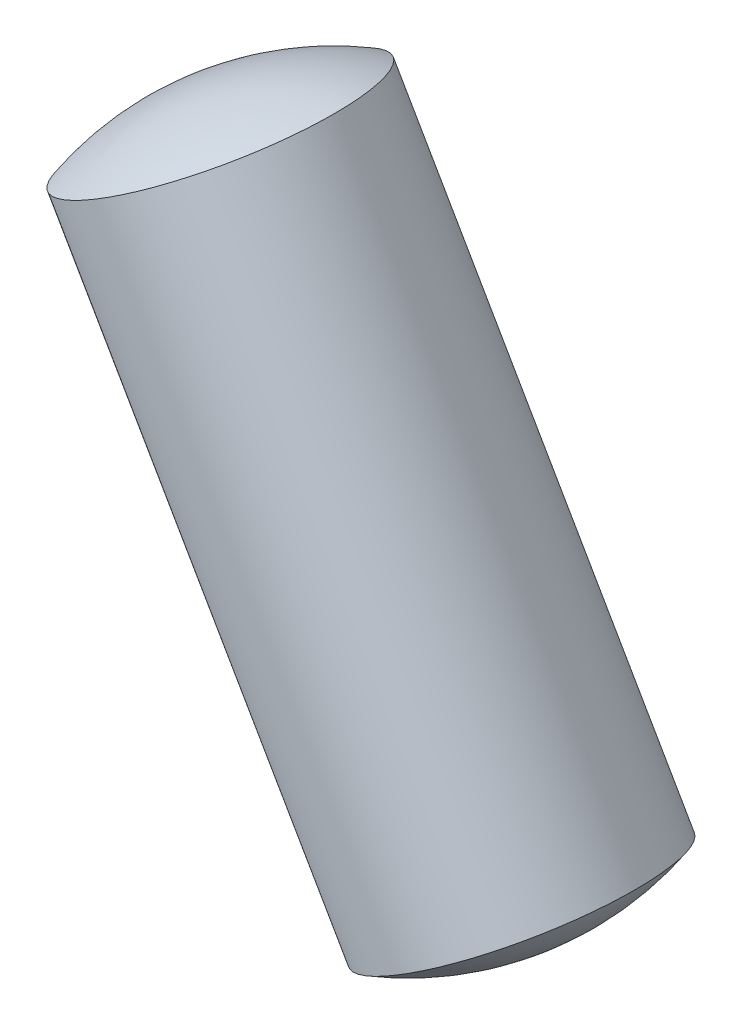
ISO-10303-21;
HEADER;
FILE_DESCRIPTION(('STEP AP214'),'2;1');
FILE_NAME('part.step','',(''),(''),'','','');
FILE_SCHEMA(('AUTOMOTIVE_DESIGN { 1 0 10303 214 1 1 1 1 }'));
ENDSEC;
DATA;
#1=APPLICATION_CONTEXT('core data for automotive mechanical design processes');
#2=APPLICATION_PROTOCOL_DEFINITION('international standard','automotive_design',2000,#1);
#3=PRODUCT_CONTEXT('',#1,'mechanical');
#4=PRODUCT('Part','Part','',(#3));
#5=PRODUCT_RELATED_PRODUCT_CATEGORY('part','',(#4));
#6=PRODUCT_DEFINITION_FORMATION('','',#4);
#7=PRODUCT_DEFINITION_CONTEXT('part definition',#1,'design');
#8=PRODUCT_DEFINITION('design','',#6,#7);
#9=PRODUCT_DEFINITION_SHAPE('','',#8);
#10=(LENGTH_UNIT() NAMED_UNIT(*) SI_UNIT(.MILLI.,.METRE.));
#11=(NAMED_UNIT(*) PLANE_ANGLE_UNIT() SI_UNIT($,.RADIAN.));
#12=(NAMED_UNIT(*) SI_UNIT($,.STERADIAN.) SOLID_ANGLE_UNIT());
#13=UNCERTAINTY_MEASURE_WITH_UNIT(LENGTH_MEASURE(1.E-05),#10,'distance_accuracy_value','');
#14=(GEOMETRIC_REPRESENTATION_CONTEXT(3) GLOBAL_UNCERTAINTY_ASSIGNED_CONTEXT((#13)) GLOBAL_UNIT_ASSIGNED_CONTEXT((#10,
#11,#12)) REPRESENTATION_CONTEXT('',''));
#15=CARTESIAN_POINT('',(0.,0.,0.));
#16=DIRECTION('',(0.,0.,1.));
#17=DIRECTION('',(1.,0.,0.));
#18=AXIS2_PLACEMENT_3D('',#15,#16,#17);
#19=CARTESIAN_POINT('',(-11.159042138627,19.3220982352424,0.599999999999989));
#20=DIRECTION('',(0.865958958119115,0.500115069612241,0.));
#21=DIRECTION('',(-0.500115069612241,0.865958958119115,0.));
#22=AXIS2_PLACEMENT_3D('',#19,#20,#21);
#23=SPHERICAL_SURFACE('',#22,2.);
#24=CARTESIAN_POINT('',(-11.159042138627,19.3220982352424,0.599999999999989));
#25=DIRECTION('',(0.500115069612241,-0.865958958119115,0.));
#26=DIRECTION('',(0.,0.,-1.));
#27=AXIS2_PLACEMENT_3D('',#24,#25,#26);
#28=SPHERICAL_SURFACE('',#27,2.);
#29=CARTESIAN_POINT('',(-12.0252668488263,20.8219831479741,0.6));
#30=DIRECTION('',(0.500115069612241,-0.865958958119115,0.));
#31=DIRECTION('',(0.,0.,-1.));
#32=AXIS2_PLACEMENT_3D('',#29,#30,#31);
#33=CIRCLE('',#32,1.);
#34=CARTESIAN_POINT('',(-12.0252668488263,20.8219831479741,-0.4));
#35=VERTEX_POINT('',#34);
#36=EDGE_CURVE('E11',#35,#35,#33,.T.);
#37=ORIENTED_EDGE('',*,*,#36,.F.);
#38=EDGE_LOOP('',(#37));
#39=FACE_BOUND('',#38,.T.);
#40=ADVANCED_FACE('F17',(#39),#28,.T.);
#41=CARTESIAN_POINT('',(-10.5959633895054,18.347116442939,0.6));
#42=DIRECTION('',(0.865958958119115,0.500115069612241,0.));
#43=DIRECTION('',(0.500115069612241,-0.865958958119115,0.));
#44=AXIS2_PLACEMENT_3D('',#41,#42,#43);
#45=SPHERICAL_SURFACE('',#44,2.);
#46=CARTESIAN_POINT('',(-10.5959633895054,18.347116442939,0.6));
#47=DIRECTION('',(0.500115069612241,-0.865958958119115,0.));
#48=DIRECTION('',(0.,0.,-1.));
#49=AXIS2_PLACEMENT_3D('',#46,#47,#48);
#50=SPHERICAL_SURFACE('',#49,2.);
#51=CARTESIAN_POINT('',(-9.72973867930616,16.8472315302074,0.6));
#52=DIRECTION('',(0.500115069612241,-0.865958958119115,0.));
#53=DIRECTION('',(0.,0.,-1.));
#54=AXIS2_PLACEMENT_3D('',#51,#52,#53);
#55=CIRCLE('',#54,1.);
#56=CARTESIAN_POINT('',(-9.72973867930616,16.8472315302074,-0.4));
#57=VERTEX_POINT('',#56);
#58=EDGE_CURVE('E20',#57,#57,#55,.T.);
#59=ORIENTED_EDGE('',*,*,#58,.T.);
#60=EDGE_LOOP('',(#59));
#61=FACE_BOUND('',#60,.T.);
#62=ADVANCED_FACE('F39',(#61),#50,.T.);
#63=CARTESIAN_POINT('',(-10.3036207216862,17.840919434649,0.6));
#64=DIRECTION('',(0.500115069612241,-0.865958958119115,0.));
#65=DIRECTION('',(0.,0.,-1.));
#66=AXIS2_PLACEMENT_3D('',#63,#64,#65);
#67=CYLINDRICAL_SURFACE('',#66,1.);
#68=ORIENTED_EDGE('',*,*,#36,.T.);
#69=EDGE_LOOP('',(#68));
#70=FACE_BOUND('',#69,.T.);
#71=ORIENTED_EDGE('',*,*,#58,.F.);
#72=EDGE_LOOP('',(#71));
#73=FACE_BOUND('',#72,.T.);
#74=ADVANCED_FACE('F51',(#70,#73),#67,.T.);
#75=CLOSED_SHELL('',(#40,#62,#74));
#76=MANIFOLD_SOLID_BREP('B1',#75);
#77=ADVANCED_BREP_SHAPE_REPRESENTATION('',(#18,#76),#14);
#78=SHAPE_DEFINITION_REPRESENTATION(#9,#77);
ENDSEC;
END-ISO-10303-21;
